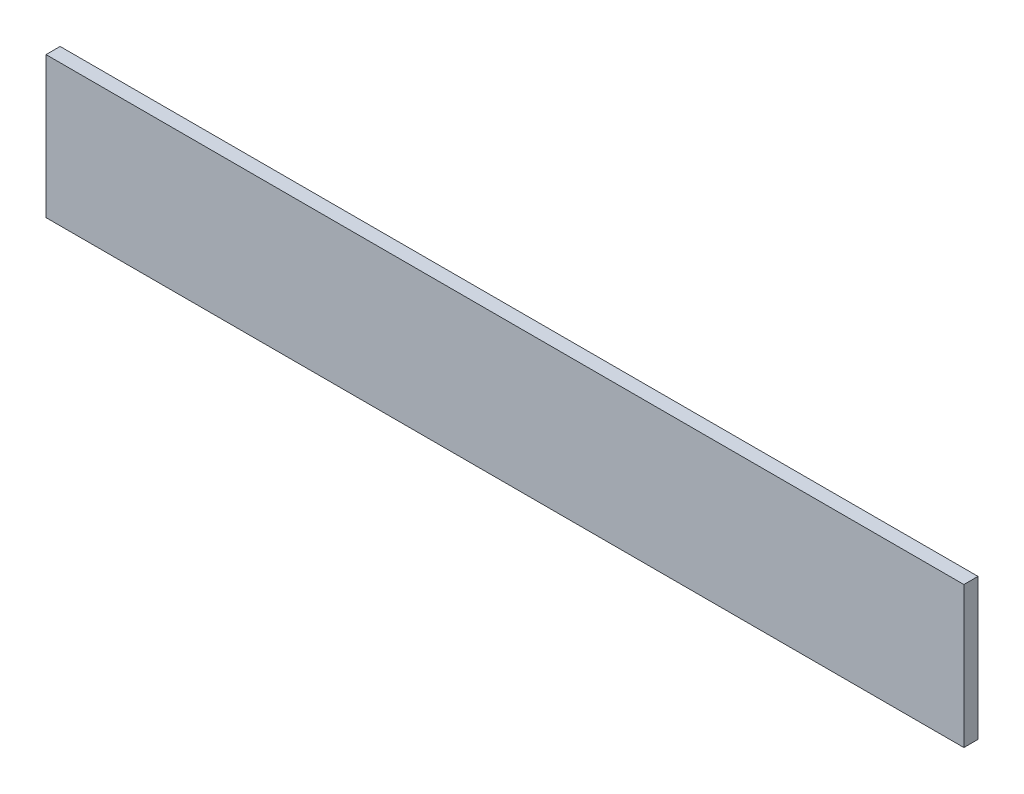
ISO-10303-21;
HEADER;
FILE_DESCRIPTION(('STEP AP214'),'2;1');
FILE_NAME('part.step','',(''),(''),'','','');
FILE_SCHEMA(('AUTOMOTIVE_DESIGN { 1 0 10303 214 1 1 1 1 }'));
ENDSEC;
DATA;
#1=APPLICATION_CONTEXT('core data for automotive mechanical design processes');
#2=APPLICATION_PROTOCOL_DEFINITION('international standard','automotive_design',2000,#1);
#3=PRODUCT_CONTEXT('',#1,'mechanical');
#4=PRODUCT('Part','Part','',(#3));
#5=PRODUCT_RELATED_PRODUCT_CATEGORY('part','',(#4));
#6=PRODUCT_DEFINITION_FORMATION('','',#4);
#7=PRODUCT_DEFINITION_CONTEXT('part definition',#1,'design');
#8=PRODUCT_DEFINITION('design','',#6,#7);
#9=PRODUCT_DEFINITION_SHAPE('','',#8);
#10=(LENGTH_UNIT() NAMED_UNIT(*) SI_UNIT(.MILLI.,.METRE.));
#11=(NAMED_UNIT(*) PLANE_ANGLE_UNIT() SI_UNIT($,.RADIAN.));
#12=(NAMED_UNIT(*) SI_UNIT($,.STERADIAN.) SOLID_ANGLE_UNIT());
#13=UNCERTAINTY_MEASURE_WITH_UNIT(LENGTH_MEASURE(1.E-05),#10,'distance_accuracy_value','');
#14=(GEOMETRIC_REPRESENTATION_CONTEXT(3) GLOBAL_UNCERTAINTY_ASSIGNED_CONTEXT((#13)) GLOBAL_UNIT_ASSIGNED_CONTEXT((#10,
#11,#12)) REPRESENTATION_CONTEXT('',''));
#15=CARTESIAN_POINT('',(0.,0.,0.));
#16=DIRECTION('',(0.,0.,1.));
#17=DIRECTION('',(1.,0.,0.));
#18=AXIS2_PLACEMENT_3D('',#15,#16,#17);
#19=CARTESIAN_POINT('',(0.,0.,2.));
#20=DIRECTION('',(1.,0.,0.));
#21=DIRECTION('',(0.,1.,0.));
#22=AXIS2_PLACEMENT_3D('',#19,#20,#21);
#23=PLANE('',#22);
#24=DIRECTION('',(0.,-1.,0.));
#25=VECTOR('',#24,1.);
#26=CARTESIAN_POINT('',(0.,0.,0.));
#27=LINE('',#26,#25);
#28=CARTESIAN_POINT('',(0.,0.,0.));
#29=VERTEX_POINT('',#28);
#30=CARTESIAN_POINT('',(0.,-20.,0.));
#31=VERTEX_POINT('',#30);
#32=EDGE_CURVE('E100',#29,#31,#27,.T.);
#33=ORIENTED_EDGE('',*,*,#32,.T.);
#34=DIRECTION('',(0.,0.,-1.));
#35=VECTOR('',#34,1.);
#36=CARTESIAN_POINT('',(0.,-20.,2.));
#37=LINE('',#36,#35);
#38=CARTESIAN_POINT('',(0.,-20.,2.));
#39=VERTEX_POINT('',#38);
#40=EDGE_CURVE('E11',#39,#31,#37,.T.);
#41=ORIENTED_EDGE('',*,*,#40,.F.);
#42=DIRECTION('',(0.,-1.,0.));
#43=VECTOR('',#42,1.);
#44=CARTESIAN_POINT('',(0.,0.,2.));
#45=LINE('',#44,#43);
#46=CARTESIAN_POINT('',(0.,0.,2.));
#47=VERTEX_POINT('',#46);
#48=EDGE_CURVE('E88',#47,#39,#45,.T.);
#49=ORIENTED_EDGE('',*,*,#48,.F.);
#50=DIRECTION('',(0.,0.,-1.));
#51=VECTOR('',#50,1.);
#52=CARTESIAN_POINT('',(0.,0.,2.));
#53=LINE('',#52,#51);
#54=EDGE_CURVE('E96',#47,#29,#53,.T.);
#55=ORIENTED_EDGE('',*,*,#54,.T.);
#56=EDGE_LOOP('',(#33,#41,#49,#55));
#57=FACE_BOUND('',#56,.T.);
#58=ADVANCED_FACE('F37',(#57),#23,.F.);
#59=CARTESIAN_POINT('',(0.,-20.,2.));
#60=DIRECTION('',(0.,1.,0.));
#61=DIRECTION('',(0.,0.,1.));
#62=AXIS2_PLACEMENT_3D('',#59,#60,#61);
#63=PLANE('',#62);
#64=DIRECTION('',(1.,0.,0.));
#65=VECTOR('',#64,1.);
#66=CARTESIAN_POINT('',(0.,-20.,0.));
#67=LINE('',#66,#65);
#68=CARTESIAN_POINT('',(130.,-20.,0.));
#69=VERTEX_POINT('',#68);
#70=EDGE_CURVE('E92',#31,#69,#67,.T.);
#71=ORIENTED_EDGE('',*,*,#70,.T.);
#72=DIRECTION('',(0.,0.,-1.));
#73=VECTOR('',#72,1.);
#74=CARTESIAN_POINT('',(130.,-20.,2.));
#75=LINE('',#74,#73);
#76=CARTESIAN_POINT('',(130.,-20.,2.));
#77=VERTEX_POINT('',#76);
#78=EDGE_CURVE('E45',#77,#69,#75,.T.);
#79=ORIENTED_EDGE('',*,*,#78,.F.);
#80=DIRECTION('',(1.,0.,0.));
#81=VECTOR('',#80,1.);
#82=CARTESIAN_POINT('',(0.,-20.,2.));
#83=LINE('',#82,#81);
#84=EDGE_CURVE('E83',#39,#77,#83,.T.);
#85=ORIENTED_EDGE('',*,*,#84,.F.);
#86=ORIENTED_EDGE('',*,*,#40,.T.);
#87=EDGE_LOOP('',(#71,#79,#85,#86));
#88=FACE_BOUND('',#87,.T.);
#89=ADVANCED_FACE('F91',(#88),#63,.F.);
#90=CARTESIAN_POINT('',(130.,0.,2.));
#91=DIRECTION('',(-1.,0.,0.));
#92=DIRECTION('',(0.,0.,1.));
#93=AXIS2_PLACEMENT_3D('',#90,#91,#92);
#94=PLANE('',#93);
#95=DIRECTION('',(0.,1.,0.));
#96=VECTOR('',#95,1.);
#97=CARTESIAN_POINT('',(130.,0.,0.));
#98=LINE('',#97,#96);
#99=CARTESIAN_POINT('',(130.,0.,0.));
#100=VERTEX_POINT('',#99);
#101=EDGE_CURVE('E70',#69,#100,#98,.T.);
#102=ORIENTED_EDGE('',*,*,#101,.T.);
#103=DIRECTION('',(0.,0.,-1.));
#104=VECTOR('',#103,1.);
#105=CARTESIAN_POINT('',(130.,0.,2.));
#106=LINE('',#105,#104);
#107=CARTESIAN_POINT('',(130.,0.,2.));
#108=VERTEX_POINT('',#107);
#109=EDGE_CURVE('E93',#108,#100,#106,.T.);
#110=ORIENTED_EDGE('',*,*,#109,.F.);
#111=DIRECTION('',(0.,1.,0.));
#112=VECTOR('',#111,1.);
#113=CARTESIAN_POINT('',(130.,0.,2.));
#114=LINE('',#113,#112);
#115=EDGE_CURVE('E86',#77,#108,#114,.T.);
#116=ORIENTED_EDGE('',*,*,#115,.F.);
#117=ORIENTED_EDGE('',*,*,#78,.T.);
#118=EDGE_LOOP('',(#102,#110,#116,#117));
#119=FACE_BOUND('',#118,.T.);
#120=ADVANCED_FACE('F94',(#119),#94,.F.);
#121=CARTESIAN_POINT('',(0.,0.,2.));
#122=DIRECTION('',(0.,-1.,0.));
#123=DIRECTION('',(0.,0.,-1.));
#124=AXIS2_PLACEMENT_3D('',#121,#122,#123);
#125=PLANE('',#124);
#126=DIRECTION('',(-1.,0.,0.));
#127=VECTOR('',#126,1.);
#128=CARTESIAN_POINT('',(0.,0.,0.));
#129=LINE('',#128,#127);
#130=EDGE_CURVE('E76',#100,#29,#129,.T.);
#131=ORIENTED_EDGE('',*,*,#130,.T.);
#132=ORIENTED_EDGE('',*,*,#54,.F.);
#133=DIRECTION('',(-1.,0.,0.));
#134=VECTOR('',#133,1.);
#135=CARTESIAN_POINT('',(0.,0.,2.));
#136=LINE('',#135,#134);
#137=EDGE_CURVE('E53',#108,#47,#136,.T.);
#138=ORIENTED_EDGE('',*,*,#137,.F.);
#139=ORIENTED_EDGE('',*,*,#109,.T.);
#140=EDGE_LOOP('',(#131,#132,#138,#139));
#141=FACE_BOUND('',#140,.T.);
#142=ADVANCED_FACE('F107',(#141),#125,.F.);
#143=CARTESIAN_POINT('',(0.,0.,2.));
#144=DIRECTION('',(0.,0.,1.));
#145=DIRECTION('',(1.,0.,0.));
#146=AXIS2_PLACEMENT_3D('',#143,#144,#145);
#147=PLANE('',#146);
#148=ORIENTED_EDGE('',*,*,#48,.T.);
#149=ORIENTED_EDGE('',*,*,#84,.T.);
#150=ORIENTED_EDGE('',*,*,#115,.T.);
#151=ORIENTED_EDGE('',*,*,#137,.T.);
#152=EDGE_LOOP('',(#148,#149,#150,#151));
#153=FACE_BOUND('',#152,.T.);
#154=ADVANCED_FACE('F84',(#153),#147,.T.);
#155=CARTESIAN_POINT('',(0.,0.,0.));
#156=DIRECTION('',(0.,0.,1.));
#157=DIRECTION('',(1.,0.,0.));
#158=AXIS2_PLACEMENT_3D('',#155,#156,#157);
#159=PLANE('',#158);
#160=ORIENTED_EDGE('',*,*,#32,.F.);
#161=ORIENTED_EDGE('',*,*,#130,.F.);
#162=ORIENTED_EDGE('',*,*,#101,.F.);
#163=ORIENTED_EDGE('',*,*,#70,.F.);
#164=EDGE_LOOP('',(#160,#161,#162,#163));
#165=FACE_BOUND('',#164,.T.);
#166=ADVANCED_FACE('F110',(#165),#159,.F.);
#167=CLOSED_SHELL('',(#58,#89,#120,#142,#154,#166));
#168=MANIFOLD_SOLID_BREP('B2',#167);
#169=ADVANCED_BREP_SHAPE_REPRESENTATION('',(#18,#168),#14);
#170=SHAPE_DEFINITION_REPRESENTATION(#9,#169);
ENDSEC;
END-ISO-10303-21;
